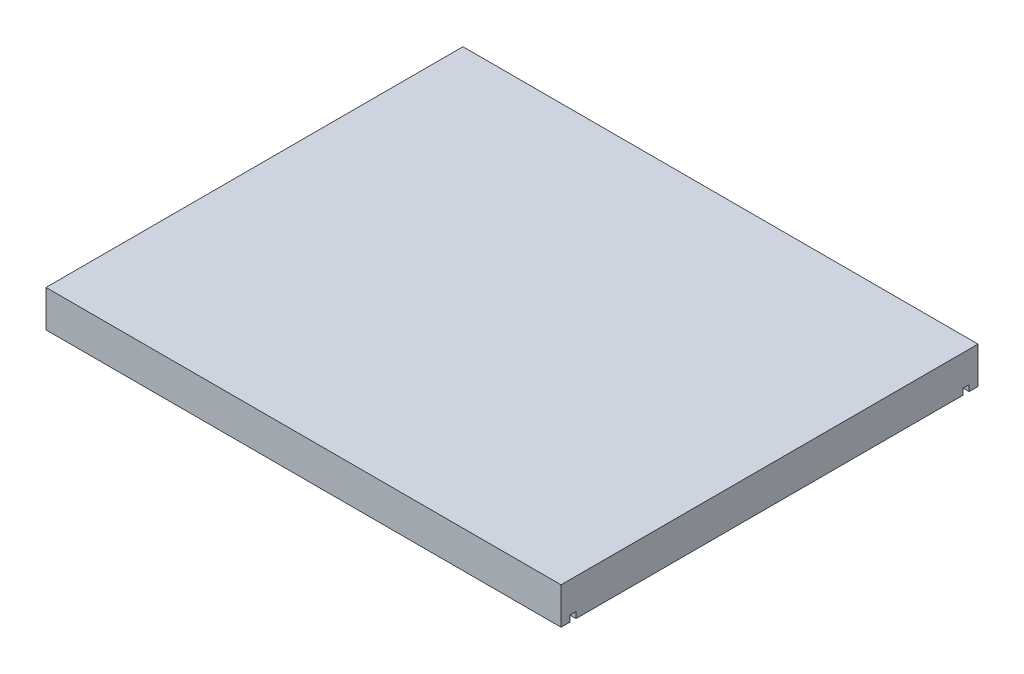
ISO-10303-21;
HEADER;
FILE_DESCRIPTION(('STEP AP214'),'2;1');
FILE_NAME('part.step','',(''),(''),'','','');
FILE_SCHEMA(('AUTOMOTIVE_DESIGN { 1 0 10303 214 1 1 1 1 }'));
ENDSEC;
DATA;
#1=APPLICATION_CONTEXT('core data for automotive mechanical design processes');
#2=APPLICATION_PROTOCOL_DEFINITION('international standard','automotive_design',2000,#1);
#3=PRODUCT_CONTEXT('',#1,'mechanical');
#4=PRODUCT('Part','Part','',(#3));
#5=PRODUCT_RELATED_PRODUCT_CATEGORY('part','',(#4));
#6=PRODUCT_DEFINITION_FORMATION('','',#4);
#7=PRODUCT_DEFINITION_CONTEXT('part definition',#1,'design');
#8=PRODUCT_DEFINITION('design','',#6,#7);
#9=PRODUCT_DEFINITION_SHAPE('','',#8);
#10=(LENGTH_UNIT() NAMED_UNIT(*) SI_UNIT(.MILLI.,.METRE.));
#11=(NAMED_UNIT(*) PLANE_ANGLE_UNIT() SI_UNIT($,.RADIAN.));
#12=(NAMED_UNIT(*) SI_UNIT($,.STERADIAN.) SOLID_ANGLE_UNIT());
#13=UNCERTAINTY_MEASURE_WITH_UNIT(LENGTH_MEASURE(1.E-05),#10,'distance_accuracy_value','');
#14=(GEOMETRIC_REPRESENTATION_CONTEXT(3) GLOBAL_UNCERTAINTY_ASSIGNED_CONTEXT((#13)) GLOBAL_UNIT_ASSIGNED_CONTEXT((#10,
#11,#12)) REPRESENTATION_CONTEXT('',''));
#15=CARTESIAN_POINT('',(0.,0.,0.));
#16=DIRECTION('',(0.,0.,1.));
#17=DIRECTION('',(1.,0.,0.));
#18=AXIS2_PLACEMENT_3D('',#15,#16,#17);
#19=CARTESIAN_POINT('',(133.35,19.05,107.95));
#20=DIRECTION('',(-1.,0.,0.));
#21=DIRECTION('',(0.,0.,1.));
#22=AXIS2_PLACEMENT_3D('',#19,#20,#21);
#23=PLANE('',#22);
#24=DIRECTION('',(0.,-1.,0.));
#25=VECTOR('',#24,1.);
#26=CARTESIAN_POINT('',(133.35,0.,-103.378));
#27=LINE('',#26,#25);
#28=CARTESIAN_POINT('',(133.35,3.175,-103.378));
#29=VERTEX_POINT('',#28);
#30=CARTESIAN_POINT('',(133.35,0.,-103.378));
#31=VERTEX_POINT('',#30);
#32=EDGE_CURVE('E145',#29,#31,#27,.T.);
#33=ORIENTED_EDGE('',*,*,#32,.T.);
#34=DIRECTION('',(0.,0.,-1.));
#35=VECTOR('',#34,1.);
#36=CARTESIAN_POINT('',(133.35,0.,107.95));
#37=LINE('',#36,#35);
#38=CARTESIAN_POINT('',(133.35,0.,-107.95));
#39=VERTEX_POINT('',#38);
#40=EDGE_CURVE('E199',#31,#39,#37,.T.);
#41=ORIENTED_EDGE('',*,*,#40,.T.);
#42=DIRECTION('',(0.,-1.,0.));
#43=VECTOR('',#42,1.);
#44=CARTESIAN_POINT('',(133.35,19.05,-107.95));
#45=LINE('',#44,#43);
#46=CARTESIAN_POINT('',(133.35,19.05,-107.95));
#47=VERTEX_POINT('',#46);
#48=EDGE_CURVE('E11',#47,#39,#45,.T.);
#49=ORIENTED_EDGE('',*,*,#48,.F.);
#50=DIRECTION('',(0.,0.,-1.));
#51=VECTOR('',#50,1.);
#52=CARTESIAN_POINT('',(133.35,19.05,107.95));
#53=LINE('',#52,#51);
#54=CARTESIAN_POINT('',(133.35,19.05,107.95));
#55=VERTEX_POINT('',#54);
#56=EDGE_CURVE('E209',#55,#47,#53,.T.);
#57=ORIENTED_EDGE('',*,*,#56,.F.);
#58=DIRECTION('',(0.,-1.,0.));
#59=VECTOR('',#58,1.);
#60=CARTESIAN_POINT('',(133.35,19.05,107.95));
#61=LINE('',#60,#59);
#62=CARTESIAN_POINT('',(133.35,0.,107.95));
#63=VERTEX_POINT('',#62);
#64=EDGE_CURVE('E223',#55,#63,#61,.T.);
#65=ORIENTED_EDGE('',*,*,#64,.T.);
#66=CARTESIAN_POINT('',(133.35,0.,103.378));
#67=VERTEX_POINT('',#66);
#68=EDGE_CURVE('E224',#63,#67,#37,.T.);
#69=ORIENTED_EDGE('',*,*,#68,.T.);
#70=DIRECTION('',(0.,-1.,0.));
#71=VECTOR('',#70,1.);
#72=CARTESIAN_POINT('',(133.35,0.,103.378));
#73=LINE('',#72,#71);
#74=CARTESIAN_POINT('',(133.35,3.175,103.378));
#75=VERTEX_POINT('',#74);
#76=EDGE_CURVE('E168',#75,#67,#73,.T.);
#77=ORIENTED_EDGE('',*,*,#76,.F.);
#78=DIRECTION('',(0.,0.,1.));
#79=VECTOR('',#78,1.);
#80=CARTESIAN_POINT('',(133.35,3.175,103.378));
#81=LINE('',#80,#79);
#82=CARTESIAN_POINT('',(133.35,3.175,100.203));
#83=VERTEX_POINT('',#82);
#84=EDGE_CURVE('E180',#83,#75,#81,.T.);
#85=ORIENTED_EDGE('',*,*,#84,.F.);
#86=DIRECTION('',(0.,1.,0.));
#87=VECTOR('',#86,1.);
#88=CARTESIAN_POINT('',(133.35,0.,100.203));
#89=LINE('',#88,#87);
#90=CARTESIAN_POINT('',(133.35,0.,100.203));
#91=VERTEX_POINT('',#90);
#92=EDGE_CURVE('E176',#91,#83,#89,.T.);
#93=ORIENTED_EDGE('',*,*,#92,.F.);
#94=CARTESIAN_POINT('',(133.35,0.,-100.203));
#95=VERTEX_POINT('',#94);
#96=EDGE_CURVE('E229',#91,#95,#37,.T.);
#97=ORIENTED_EDGE('',*,*,#96,.T.);
#98=DIRECTION('',(0.,1.,0.));
#99=VECTOR('',#98,1.);
#100=CARTESIAN_POINT('',(133.35,0.,-100.203));
#101=LINE('',#100,#99);
#102=CARTESIAN_POINT('',(133.35,3.175,-100.203));
#103=VERTEX_POINT('',#102);
#104=EDGE_CURVE('E54',#95,#103,#101,.T.);
#105=ORIENTED_EDGE('',*,*,#104,.T.);
#106=DIRECTION('',(0.,0.,-1.));
#107=VECTOR('',#106,1.);
#108=CARTESIAN_POINT('',(133.35,3.175,-103.378));
#109=LINE('',#108,#107);
#110=EDGE_CURVE('E135',#103,#29,#109,.T.);
#111=ORIENTED_EDGE('',*,*,#110,.T.);
#112=EDGE_LOOP('',(#33,#41,#49,#57,#65,#69,#77,#85,#93,#97,#105,#111));
#113=FACE_BOUND('',#112,.T.);
#114=ADVANCED_FACE('F39',(#113),#23,.F.);
#115=CARTESIAN_POINT('',(-133.35,19.05,107.95));
#116=DIRECTION('',(1.,0.,0.));
#117=DIRECTION('',(0.,0.,-1.));
#118=AXIS2_PLACEMENT_3D('',#115,#116,#117);
#119=PLANE('',#118);
#120=DIRECTION('',(0.,-1.,0.));
#121=VECTOR('',#120,1.);
#122=CARTESIAN_POINT('',(-133.35,0.,-103.378));
#123=LINE('',#122,#121);
#124=CARTESIAN_POINT('',(-133.35,3.175,-103.378));
#125=VERTEX_POINT('',#124);
#126=CARTESIAN_POINT('',(-133.35,0.,-103.378));
#127=VERTEX_POINT('',#126);
#128=EDGE_CURVE('E157',#125,#127,#123,.T.);
#129=ORIENTED_EDGE('',*,*,#128,.F.);
#130=DIRECTION('',(0.,0.,-1.));
#131=VECTOR('',#130,1.);
#132=CARTESIAN_POINT('',(-133.35,3.175,-103.378));
#133=LINE('',#132,#131);
#134=CARTESIAN_POINT('',(-133.35,3.175,-100.203));
#135=VERTEX_POINT('',#134);
#136=EDGE_CURVE('E137',#135,#125,#133,.T.);
#137=ORIENTED_EDGE('',*,*,#136,.F.);
#138=DIRECTION('',(0.,1.,0.));
#139=VECTOR('',#138,1.);
#140=CARTESIAN_POINT('',(-133.35,0.,-100.203));
#141=LINE('',#140,#139);
#142=CARTESIAN_POINT('',(-133.35,0.,-100.203));
#143=VERTEX_POINT('',#142);
#144=EDGE_CURVE('E142',#143,#135,#141,.T.);
#145=ORIENTED_EDGE('',*,*,#144,.F.);
#146=DIRECTION('',(0.,0.,1.));
#147=VECTOR('',#146,1.);
#148=CARTESIAN_POINT('',(-133.35,0.,107.95));
#149=LINE('',#148,#147);
#150=CARTESIAN_POINT('',(-133.35,0.,100.203));
#151=VERTEX_POINT('',#150);
#152=EDGE_CURVE('E62',#143,#151,#149,.T.);
#153=ORIENTED_EDGE('',*,*,#152,.T.);
#154=DIRECTION('',(0.,1.,0.));
#155=VECTOR('',#154,1.);
#156=CARTESIAN_POINT('',(-133.35,0.,100.203));
#157=LINE('',#156,#155);
#158=CARTESIAN_POINT('',(-133.35,3.175,100.203));
#159=VERTEX_POINT('',#158);
#160=EDGE_CURVE('E188',#151,#159,#157,.T.);
#161=ORIENTED_EDGE('',*,*,#160,.T.);
#162=DIRECTION('',(0.,0.,1.));
#163=VECTOR('',#162,1.);
#164=CARTESIAN_POINT('',(-133.35,3.175,103.378));
#165=LINE('',#164,#163);
#166=CARTESIAN_POINT('',(-133.35,3.175,103.378));
#167=VERTEX_POINT('',#166);
#168=EDGE_CURVE('E191',#159,#167,#165,.T.);
#169=ORIENTED_EDGE('',*,*,#168,.T.);
#170=DIRECTION('',(0.,-1.,0.));
#171=VECTOR('',#170,1.);
#172=CARTESIAN_POINT('',(-133.35,0.,103.378));
#173=LINE('',#172,#171);
#174=CARTESIAN_POINT('',(-133.35,0.,103.378));
#175=VERTEX_POINT('',#174);
#176=EDGE_CURVE('E184',#167,#175,#173,.T.);
#177=ORIENTED_EDGE('',*,*,#176,.T.);
#178=CARTESIAN_POINT('',(-133.35,0.,107.95));
#179=VERTEX_POINT('',#178);
#180=EDGE_CURVE('E232',#175,#179,#149,.T.);
#181=ORIENTED_EDGE('',*,*,#180,.T.);
#182=DIRECTION('',(0.,-1.,0.));
#183=VECTOR('',#182,1.);
#184=CARTESIAN_POINT('',(-133.35,19.05,107.95));
#185=LINE('',#184,#183);
#186=CARTESIAN_POINT('',(-133.35,19.05,107.95));
#187=VERTEX_POINT('',#186);
#188=EDGE_CURVE('E242',#187,#179,#185,.T.);
#189=ORIENTED_EDGE('',*,*,#188,.F.);
#190=DIRECTION('',(0.,0.,1.));
#191=VECTOR('',#190,1.);
#192=CARTESIAN_POINT('',(-133.35,19.05,107.95));
#193=LINE('',#192,#191);
#194=CARTESIAN_POINT('',(-133.35,19.05,-107.95));
#195=VERTEX_POINT('',#194);
#196=EDGE_CURVE('E217',#195,#187,#193,.T.);
#197=ORIENTED_EDGE('',*,*,#196,.F.);
#198=DIRECTION('',(0.,-1.,0.));
#199=VECTOR('',#198,1.);
#200=CARTESIAN_POINT('',(-133.35,19.05,-107.95));
#201=LINE('',#200,#199);
#202=CARTESIAN_POINT('',(-133.35,0.,-107.95));
#203=VERTEX_POINT('',#202);
#204=EDGE_CURVE('E47',#195,#203,#201,.T.);
#205=ORIENTED_EDGE('',*,*,#204,.T.);
#206=EDGE_CURVE('E233',#203,#127,#149,.T.);
#207=ORIENTED_EDGE('',*,*,#206,.T.);
#208=EDGE_LOOP('',(#129,#137,#145,#153,#161,#169,#177,#181,#189,#197,#205,#207));
#209=FACE_BOUND('',#208,.T.);
#210=ADVANCED_FACE('F250',(#209),#119,.F.);
#211=CARTESIAN_POINT('',(0.,0.,0.));
#212=DIRECTION('',(0.,-1.,0.));
#213=DIRECTION('',(0.,0.,-1.));
#214=AXIS2_PLACEMENT_3D('',#211,#212,#213);
#215=PLANE('',#214);
#216=ORIENTED_EDGE('',*,*,#40,.F.);
#217=DIRECTION('',(1.,0.,0.));
#218=VECTOR('',#217,1.);
#219=CARTESIAN_POINT('',(-133.35,0.,-103.378));
#220=LINE('',#219,#218);
#221=EDGE_CURVE('E148',#127,#31,#220,.T.);
#222=ORIENTED_EDGE('',*,*,#221,.F.);
#223=ORIENTED_EDGE('',*,*,#206,.F.);
#224=DIRECTION('',(-1.,0.,0.));
#225=VECTOR('',#224,1.);
#226=CARTESIAN_POINT('',(-133.35,0.,-107.95));
#227=LINE('',#226,#225);
#228=EDGE_CURVE('E228',#39,#203,#227,.T.);
#229=ORIENTED_EDGE('',*,*,#228,.F.);
#230=EDGE_LOOP('',(#216,#222,#223,#229));
#231=FACE_BOUND('',#230,.T.);
#232=ADVANCED_FACE('F255',(#231),#215,.T.);
#233=ORIENTED_EDGE('',*,*,#152,.F.);
#234=DIRECTION('',(1.,0.,0.));
#235=VECTOR('',#234,1.);
#236=CARTESIAN_POINT('',(-133.35,0.,-100.203));
#237=LINE('',#236,#235);
#238=EDGE_CURVE('E169',#143,#95,#237,.T.);
#239=ORIENTED_EDGE('',*,*,#238,.T.);
#240=ORIENTED_EDGE('',*,*,#96,.F.);
#241=DIRECTION('',(1.,0.,0.));
#242=VECTOR('',#241,1.);
#243=CARTESIAN_POINT('',(-133.35,0.,100.203));
#244=LINE('',#243,#242);
#245=EDGE_CURVE('E203',#151,#91,#244,.T.);
#246=ORIENTED_EDGE('',*,*,#245,.F.);
#247=EDGE_LOOP('',(#233,#239,#240,#246));
#248=FACE_BOUND('',#247,.T.);
#249=ADVANCED_FACE('F264',(#248),#215,.T.);
#250=DIRECTION('',(1.,0.,0.));
#251=VECTOR('',#250,1.);
#252=CARTESIAN_POINT('',(-133.35,0.,103.378));
#253=LINE('',#252,#251);
#254=EDGE_CURVE('E195',#175,#67,#253,.T.);
#255=ORIENTED_EDGE('',*,*,#254,.T.);
#256=ORIENTED_EDGE('',*,*,#68,.F.);
#257=DIRECTION('',(1.,0.,0.));
#258=VECTOR('',#257,1.);
#259=CARTESIAN_POINT('',(-133.35,0.,107.95));
#260=LINE('',#259,#258);
#261=EDGE_CURVE('E214',#179,#63,#260,.T.);
#262=ORIENTED_EDGE('',*,*,#261,.F.);
#263=ORIENTED_EDGE('',*,*,#180,.F.);
#264=EDGE_LOOP('',(#255,#256,#262,#263));
#265=FACE_BOUND('',#264,.T.);
#266=ADVANCED_FACE('F284',(#265),#215,.T.);
#267=CARTESIAN_POINT('',(-133.35,19.05,-107.95));
#268=DIRECTION('',(0.,0.,1.));
#269=DIRECTION('',(1.,0.,0.));
#270=AXIS2_PLACEMENT_3D('',#267,#268,#269);
#271=PLANE('',#270);
#272=ORIENTED_EDGE('',*,*,#228,.T.);
#273=ORIENTED_EDGE('',*,*,#204,.F.);
#274=DIRECTION('',(-1.,0.,0.));
#275=VECTOR('',#274,1.);
#276=CARTESIAN_POINT('',(-133.35,19.05,-107.95));
#277=LINE('',#276,#275);
#278=EDGE_CURVE('E213',#47,#195,#277,.T.);
#279=ORIENTED_EDGE('',*,*,#278,.F.);
#280=ORIENTED_EDGE('',*,*,#48,.T.);
#281=EDGE_LOOP('',(#272,#273,#279,#280));
#282=FACE_BOUND('',#281,.T.);
#283=ADVANCED_FACE('F287',(#282),#271,.F.);
#284=CARTESIAN_POINT('',(-133.35,19.05,107.95));
#285=DIRECTION('',(0.,0.,-1.));
#286=DIRECTION('',(-1.,0.,0.));
#287=AXIS2_PLACEMENT_3D('',#284,#285,#286);
#288=PLANE('',#287);
#289=ORIENTED_EDGE('',*,*,#261,.T.);
#290=ORIENTED_EDGE('',*,*,#64,.F.);
#291=DIRECTION('',(1.,0.,0.));
#292=VECTOR('',#291,1.);
#293=CARTESIAN_POINT('',(-133.35,19.05,107.95));
#294=LINE('',#293,#292);
#295=EDGE_CURVE('E220',#187,#55,#294,.T.);
#296=ORIENTED_EDGE('',*,*,#295,.F.);
#297=ORIENTED_EDGE('',*,*,#188,.T.);
#298=EDGE_LOOP('',(#289,#290,#296,#297));
#299=FACE_BOUND('',#298,.T.);
#300=ADVANCED_FACE('F286',(#299),#288,.F.);
#301=CARTESIAN_POINT('',(0.,19.05,0.));
#302=DIRECTION('',(0.,-1.,0.));
#303=DIRECTION('',(0.,0.,-1.));
#304=AXIS2_PLACEMENT_3D('',#301,#302,#303);
#305=PLANE('',#304);
#306=ORIENTED_EDGE('',*,*,#56,.T.);
#307=ORIENTED_EDGE('',*,*,#278,.T.);
#308=ORIENTED_EDGE('',*,*,#196,.T.);
#309=ORIENTED_EDGE('',*,*,#295,.T.);
#310=EDGE_LOOP('',(#306,#307,#308,#309));
#311=FACE_BOUND('',#310,.T.);
#312=ADVANCED_FACE('F293',(#311),#305,.F.);
#313=CARTESIAN_POINT('',(-133.35,0.,103.378));
#314=DIRECTION('',(0.,0.,1.));
#315=DIRECTION('',(1.,0.,0.));
#316=AXIS2_PLACEMENT_3D('',#313,#314,#315);
#317=PLANE('',#316);
#318=ORIENTED_EDGE('',*,*,#254,.F.);
#319=ORIENTED_EDGE('',*,*,#176,.F.);
#320=DIRECTION('',(1.,0.,0.));
#321=VECTOR('',#320,1.);
#322=CARTESIAN_POINT('',(-133.35,3.175,103.378));
#323=LINE('',#322,#321);
#324=EDGE_CURVE('E196',#167,#75,#323,.T.);
#325=ORIENTED_EDGE('',*,*,#324,.T.);
#326=ORIENTED_EDGE('',*,*,#76,.T.);
#327=EDGE_LOOP('',(#318,#319,#325,#326));
#328=FACE_BOUND('',#327,.T.);
#329=ADVANCED_FACE('F305',(#328),#317,.F.);
#330=CARTESIAN_POINT('',(-133.35,3.175,103.378));
#331=DIRECTION('',(0.,1.,0.));
#332=DIRECTION('',(0.,0.,1.));
#333=AXIS2_PLACEMENT_3D('',#330,#331,#332);
#334=PLANE('',#333);
#335=ORIENTED_EDGE('',*,*,#324,.F.);
#336=ORIENTED_EDGE('',*,*,#168,.F.);
#337=DIRECTION('',(1.,0.,0.));
#338=VECTOR('',#337,1.);
#339=CARTESIAN_POINT('',(-133.35,3.175,100.203));
#340=LINE('',#339,#338);
#341=EDGE_CURVE('E200',#159,#83,#340,.T.);
#342=ORIENTED_EDGE('',*,*,#341,.T.);
#343=ORIENTED_EDGE('',*,*,#84,.T.);
#344=EDGE_LOOP('',(#335,#336,#342,#343));
#345=FACE_BOUND('',#344,.T.);
#346=ADVANCED_FACE('F309',(#345),#334,.F.);
#347=CARTESIAN_POINT('',(-133.35,0.,100.203));
#348=DIRECTION('',(0.,0.,-1.));
#349=DIRECTION('',(-1.,0.,0.));
#350=AXIS2_PLACEMENT_3D('',#347,#348,#349);
#351=PLANE('',#350);
#352=ORIENTED_EDGE('',*,*,#341,.F.);
#353=ORIENTED_EDGE('',*,*,#160,.F.);
#354=ORIENTED_EDGE('',*,*,#245,.T.);
#355=ORIENTED_EDGE('',*,*,#92,.T.);
#356=EDGE_LOOP('',(#352,#353,#354,#355));
#357=FACE_BOUND('',#356,.T.);
#358=ADVANCED_FACE('F273',(#357),#351,.F.);
#359=CARTESIAN_POINT('',(-133.35,0.,-103.378));
#360=DIRECTION('',(0.,0.,1.));
#361=DIRECTION('',(1.,0.,0.));
#362=AXIS2_PLACEMENT_3D('',#359,#360,#361);
#363=PLANE('',#362);
#364=DIRECTION('',(1.,0.,0.));
#365=VECTOR('',#364,1.);
#366=CARTESIAN_POINT('',(-133.35,3.175,-103.378));
#367=LINE('',#366,#365);
#368=EDGE_CURVE('E130',#125,#29,#367,.T.);
#369=ORIENTED_EDGE('',*,*,#368,.F.);
#370=ORIENTED_EDGE('',*,*,#128,.T.);
#371=ORIENTED_EDGE('',*,*,#221,.T.);
#372=ORIENTED_EDGE('',*,*,#32,.F.);
#373=EDGE_LOOP('',(#369,#370,#371,#372));
#374=FACE_BOUND('',#373,.T.);
#375=ADVANCED_FACE('F146',(#374),#363,.T.);
#376=CARTESIAN_POINT('',(-133.35,0.,-100.203));
#377=DIRECTION('',(0.,0.,-1.));
#378=DIRECTION('',(-1.,0.,0.));
#379=AXIS2_PLACEMENT_3D('',#376,#377,#378);
#380=PLANE('',#379);
#381=ORIENTED_EDGE('',*,*,#238,.F.);
#382=ORIENTED_EDGE('',*,*,#144,.T.);
#383=DIRECTION('',(1.,0.,0.));
#384=VECTOR('',#383,1.);
#385=CARTESIAN_POINT('',(-133.35,3.175,-100.203));
#386=LINE('',#385,#384);
#387=EDGE_CURVE('E141',#135,#103,#386,.T.);
#388=ORIENTED_EDGE('',*,*,#387,.T.);
#389=ORIENTED_EDGE('',*,*,#104,.F.);
#390=EDGE_LOOP('',(#381,#382,#388,#389));
#391=FACE_BOUND('',#390,.T.);
#392=ADVANCED_FACE('F265',(#391),#380,.T.);
#393=CARTESIAN_POINT('',(-133.35,3.175,-103.378));
#394=DIRECTION('',(0.,-1.,0.));
#395=DIRECTION('',(0.,0.,-1.));
#396=AXIS2_PLACEMENT_3D('',#393,#394,#395);
#397=PLANE('',#396);
#398=ORIENTED_EDGE('',*,*,#387,.F.);
#399=ORIENTED_EDGE('',*,*,#136,.T.);
#400=ORIENTED_EDGE('',*,*,#368,.T.);
#401=ORIENTED_EDGE('',*,*,#110,.F.);
#402=EDGE_LOOP('',(#398,#399,#400,#401));
#403=FACE_BOUND('',#402,.T.);
#404=ADVANCED_FACE('F133',(#403),#397,.T.);
#405=CLOSED_SHELL('',(#114,#210,#232,#249,#266,#283,#300,#312,#329,#346,#358,#375,#392,#404));
#406=MANIFOLD_SOLID_BREP('B2',#405);
#407=ADVANCED_BREP_SHAPE_REPRESENTATION('',(#18,#406),#14);
#408=SHAPE_DEFINITION_REPRESENTATION(#9,#407);
ENDSEC;
END-ISO-10303-21;
